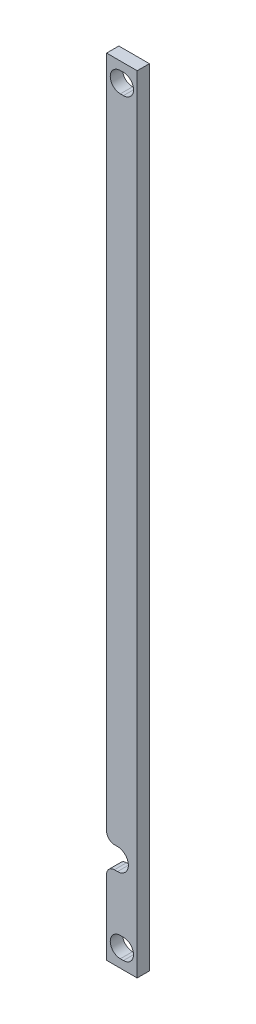
ISO-10303-21;
HEADER;
FILE_DESCRIPTION(('STEP AP214'),'2;1');
FILE_NAME('part.step','',(''),(''),'','','');
FILE_SCHEMA(('AUTOMOTIVE_DESIGN { 1 0 10303 214 1 1 1 1 }'));
ENDSEC;
DATA;
#1=APPLICATION_CONTEXT('core data for automotive mechanical design processes');
#2=APPLICATION_PROTOCOL_DEFINITION('international standard','automotive_design',2000,#1);
#3=PRODUCT_CONTEXT('',#1,'mechanical');
#4=PRODUCT('Part','Part','',(#3));
#5=PRODUCT_RELATED_PRODUCT_CATEGORY('part','',(#4));
#6=PRODUCT_DEFINITION_FORMATION('','',#4);
#7=PRODUCT_DEFINITION_CONTEXT('part definition',#1,'design');
#8=PRODUCT_DEFINITION('design','',#6,#7);
#9=PRODUCT_DEFINITION_SHAPE('','',#8);
#10=(LENGTH_UNIT() NAMED_UNIT(*) SI_UNIT(.MILLI.,.METRE.));
#11=(NAMED_UNIT(*) PLANE_ANGLE_UNIT() SI_UNIT($,.RADIAN.));
#12=(NAMED_UNIT(*) SI_UNIT($,.STERADIAN.) SOLID_ANGLE_UNIT());
#13=UNCERTAINTY_MEASURE_WITH_UNIT(LENGTH_MEASURE(1.E-05),#10,'distance_accuracy_value','');
#14=(GEOMETRIC_REPRESENTATION_CONTEXT(3) GLOBAL_UNCERTAINTY_ASSIGNED_CONTEXT((#13)) GLOBAL_UNIT_ASSIGNED_CONTEXT((#10,
#11,#12)) REPRESENTATION_CONTEXT('',''));
#15=CARTESIAN_POINT('',(0.,0.,0.));
#16=DIRECTION('',(0.,0.,1.));
#17=DIRECTION('',(1.,0.,0.));
#18=AXIS2_PLACEMENT_3D('',#15,#16,#17);
#19=CARTESIAN_POINT('',(-2.50000000000001,64.25,2.));
#20=DIRECTION('',(1.,0.,0.));
#21=DIRECTION('',(0.,1.,0.));
#22=AXIS2_PLACEMENT_3D('',#19,#20,#21);
#23=PLANE('',#22);
#24=DIRECTION('',(0.,-1.,0.));
#25=VECTOR('',#24,1.);
#26=CARTESIAN_POINT('',(-2.50000000000001,64.25,2.));
#27=LINE('',#26,#25);
#28=CARTESIAN_POINT('',(-2.49999999999999,-52.058,2.));
#29=VERTEX_POINT('',#28);
#30=CARTESIAN_POINT('',(-2.49999999999999,-64.25,2.));
#31=VERTEX_POINT('',#30);
#32=EDGE_CURVE('E300',#29,#31,#27,.T.);
#33=ORIENTED_EDGE('',*,*,#32,.F.);
#34=DIRECTION('',(0.,0.,-1.));
#35=VECTOR('',#34,1.);
#36=CARTESIAN_POINT('',(-2.49999999999999,-52.058,2.));
#37=LINE('',#36,#35);
#38=CARTESIAN_POINT('',(-2.49999999999999,-52.058,0.));
#39=VERTEX_POINT('',#38);
#40=EDGE_CURVE('E339',#29,#39,#37,.T.);
#41=ORIENTED_EDGE('',*,*,#40,.T.);
#42=DIRECTION('',(0.,-1.,0.));
#43=VECTOR('',#42,1.);
#44=CARTESIAN_POINT('',(-2.50000000000001,64.25,0.));
#45=LINE('',#44,#43);
#46=CARTESIAN_POINT('',(-2.49999999999999,-64.25,0.));
#47=VERTEX_POINT('',#46);
#48=EDGE_CURVE('E314',#39,#47,#45,.T.);
#49=ORIENTED_EDGE('',*,*,#48,.T.);
#50=DIRECTION('',(0.,0.,-1.));
#51=VECTOR('',#50,1.);
#52=CARTESIAN_POINT('',(-2.49999999999999,-64.25,2.));
#53=LINE('',#52,#51);
#54=EDGE_CURVE('E324',#31,#47,#53,.T.);
#55=ORIENTED_EDGE('',*,*,#54,.F.);
#56=EDGE_LOOP('',(#33,#41,#49,#55));
#57=FACE_BOUND('',#56,.T.);
#58=ADVANCED_FACE('F45',(#57),#23,.F.);
#59=CARTESIAN_POINT('',(0.,0.,2.));
#60=DIRECTION('',(0.,0.,1.));
#61=DIRECTION('',(1.,0.,0.));
#62=AXIS2_PLACEMENT_3D('',#59,#60,#61);
#63=PLANE('',#62);
#64=DIRECTION('',(1.,0.,0.));
#65=VECTOR('',#64,1.);
#66=CARTESIAN_POINT('',(-2.49999999999999,-50.788,2.));
#67=LINE('',#66,#65);
#68=CARTESIAN_POINT('',(-1.22999999999999,-50.788,2.));
#69=VERTEX_POINT('',#68);
#70=CARTESIAN_POINT('',(-0.722000000000006,-50.788,2.));
#71=VERTEX_POINT('',#70);
#72=EDGE_CURVE('E181',#69,#71,#67,.T.);
#73=ORIENTED_EDGE('',*,*,#72,.F.);
#74=CARTESIAN_POINT('',(-1.22999999999999,-52.058,2.));
#75=DIRECTION('',(0.,0.,1.));
#76=DIRECTION('',(1.,0.,0.));
#77=AXIS2_PLACEMENT_3D('',#74,#75,#76);
#78=CIRCLE('',#77,1.27);
#79=EDGE_CURVE('E354',#69,#29,#78,.T.);
#80=ORIENTED_EDGE('',*,*,#79,.T.);
#81=ORIENTED_EDGE('',*,*,#32,.T.);
#82=DIRECTION('',(1.,0.,0.));
#83=VECTOR('',#82,1.);
#84=CARTESIAN_POINT('',(-2.49999999999999,-64.25,2.));
#85=LINE('',#84,#83);
#86=CARTESIAN_POINT('',(2.50000000000001,-64.25,2.));
#87=VERTEX_POINT('',#86);
#88=EDGE_CURVE('E304',#31,#87,#85,.T.);
#89=ORIENTED_EDGE('',*,*,#88,.T.);
#90=DIRECTION('',(0.,1.,0.));
#91=VECTOR('',#90,1.);
#92=CARTESIAN_POINT('',(2.49999999999999,64.25,2.));
#93=LINE('',#92,#91);
#94=CARTESIAN_POINT('',(2.49999999999999,64.25,2.));
#95=VERTEX_POINT('',#94);
#96=EDGE_CURVE('E292',#87,#95,#93,.T.);
#97=ORIENTED_EDGE('',*,*,#96,.T.);
#98=DIRECTION('',(-1.,0.,0.));
#99=VECTOR('',#98,1.);
#100=CARTESIAN_POINT('',(-2.50000000000001,64.25,2.));
#101=LINE('',#100,#99);
#102=CARTESIAN_POINT('',(-2.50000000000001,64.25,2.));
#103=VERTEX_POINT('',#102);
#104=EDGE_CURVE('E296',#95,#103,#101,.T.);
#105=ORIENTED_EDGE('',*,*,#104,.T.);
#106=CARTESIAN_POINT('',(-2.49999999999999,-45.962,2.));
#107=VERTEX_POINT('',#106);
#108=EDGE_CURVE('E301',#103,#107,#27,.T.);
#109=ORIENTED_EDGE('',*,*,#108,.T.);
#110=CARTESIAN_POINT('',(-1.22999999999999,-45.962,2.));
#111=DIRECTION('',(0.,0.,1.));
#112=DIRECTION('',(1.,0.,0.));
#113=AXIS2_PLACEMENT_3D('',#110,#111,#112);
#114=CIRCLE('',#113,1.27);
#115=CARTESIAN_POINT('',(-1.23,-47.232,2.));
#116=VERTEX_POINT('',#115);
#117=EDGE_CURVE('E61',#107,#116,#114,.T.);
#118=ORIENTED_EDGE('',*,*,#117,.T.);
#119=DIRECTION('',(-1.,0.,0.));
#120=VECTOR('',#119,1.);
#121=CARTESIAN_POINT('',(-0.722000000000006,-47.232,2.));
#122=LINE('',#121,#120);
#123=CARTESIAN_POINT('',(-0.722000000000006,-47.232,2.));
#124=VERTEX_POINT('',#123);
#125=EDGE_CURVE('E173',#124,#116,#122,.T.);
#126=ORIENTED_EDGE('',*,*,#125,.F.);
#127=CARTESIAN_POINT('',(-0.722000000000006,-49.01,2.));
#128=DIRECTION('',(0.,0.,1.));
#129=DIRECTION('',(1.,0.,0.));
#130=AXIS2_PLACEMENT_3D('',#127,#128,#129);
#131=CIRCLE('',#130,1.778);
#132=EDGE_CURVE('E185',#71,#124,#131,.T.);
#133=ORIENTED_EDGE('',*,*,#132,.F.);
#134=EDGE_LOOP('',(#73,#80,#81,#89,#97,#105,#109,#118,#126,#133));
#135=FACE_BOUND('',#134,.T.);
#136=DIRECTION('',(1.,0.,0.));
#137=VECTOR('',#136,1.);
#138=CARTESIAN_POINT('',(-0.253999999999985,-62.9,2.));
#139=LINE('',#138,#137);
#140=CARTESIAN_POINT('',(-0.253999999999985,-62.9,2.));
#141=VERTEX_POINT('',#140);
#142=CARTESIAN_POINT('',(0.254000000000016,-62.9,2.));
#143=VERTEX_POINT('',#142);
#144=EDGE_CURVE('E252',#141,#143,#139,.T.);
#145=ORIENTED_EDGE('',*,*,#144,.F.);
#146=CARTESIAN_POINT('',(-0.253999999999984,-61.25,2.));
#147=DIRECTION('',(0.,0.,1.));
#148=DIRECTION('',(1.,0.,0.));
#149=AXIS2_PLACEMENT_3D('',#146,#147,#148);
#150=CIRCLE('',#149,1.65);
#151=CARTESIAN_POINT('',(-0.253999999999985,-59.6,2.));
#152=VERTEX_POINT('',#151);
#153=EDGE_CURVE('E249',#152,#141,#150,.T.);
#154=ORIENTED_EDGE('',*,*,#153,.F.);
#155=DIRECTION('',(-1.,0.,0.));
#156=VECTOR('',#155,1.);
#157=CARTESIAN_POINT('',(-0.253999999999985,-59.6,2.));
#158=LINE('',#157,#156);
#159=CARTESIAN_POINT('',(0.254000000000015,-59.6,2.));
#160=VERTEX_POINT('',#159);
#161=EDGE_CURVE('E260',#160,#152,#158,.T.);
#162=ORIENTED_EDGE('',*,*,#161,.F.);
#163=CARTESIAN_POINT('',(0.254000000000015,-61.25,2.));
#164=DIRECTION('',(0.,0.,1.));
#165=DIRECTION('',(1.,0.,0.));
#166=AXIS2_PLACEMENT_3D('',#163,#164,#165);
#167=CIRCLE('',#166,1.65);
#168=EDGE_CURVE('E256',#143,#160,#167,.T.);
#169=ORIENTED_EDGE('',*,*,#168,.F.);
#170=EDGE_LOOP('',(#145,#154,#162,#169));
#171=FACE_BOUND('',#170,.T.);
#172=DIRECTION('',(1.,0.,0.));
#173=VECTOR('',#172,1.);
#174=CARTESIAN_POINT('',(-0.253999999999999,59.6,2.));
#175=LINE('',#174,#173);
#176=CARTESIAN_POINT('',(-0.253999999999999,59.6,2.));
#177=VERTEX_POINT('',#176);
#178=CARTESIAN_POINT('',(0.254,59.6,2.));
#179=VERTEX_POINT('',#178);
#180=EDGE_CURVE('E209',#177,#179,#175,.T.);
#181=ORIENTED_EDGE('',*,*,#180,.F.);
#182=CARTESIAN_POINT('',(-0.254,61.25,2.));
#183=DIRECTION('',(0.,0.,1.));
#184=DIRECTION('',(1.,0.,0.));
#185=AXIS2_PLACEMENT_3D('',#182,#183,#184);
#186=CIRCLE('',#185,1.65);
#187=CARTESIAN_POINT('',(-0.254,62.9,2.));
#188=VERTEX_POINT('',#187);
#189=EDGE_CURVE('E206',#188,#177,#186,.T.);
#190=ORIENTED_EDGE('',*,*,#189,.F.);
#191=DIRECTION('',(-1.,0.,0.));
#192=VECTOR('',#191,1.);
#193=CARTESIAN_POINT('',(-0.254,62.9,2.));
#194=LINE('',#193,#192);
#195=CARTESIAN_POINT('',(0.254,62.9,2.));
#196=VERTEX_POINT('',#195);
#197=EDGE_CURVE('E217',#196,#188,#194,.T.);
#198=ORIENTED_EDGE('',*,*,#197,.F.);
#199=CARTESIAN_POINT('',(0.254,61.25,2.));
#200=DIRECTION('',(0.,0.,1.));
#201=DIRECTION('',(1.,0.,0.));
#202=AXIS2_PLACEMENT_3D('',#199,#200,#201);
#203=CIRCLE('',#202,1.65);
#204=EDGE_CURVE('E213',#179,#196,#203,.T.);
#205=ORIENTED_EDGE('',*,*,#204,.F.);
#206=EDGE_LOOP('',(#181,#190,#198,#205));
#207=FACE_BOUND('',#206,.T.);
#208=ADVANCED_FACE('F191',(#135,#171,#207),#63,.T.);
#209=CARTESIAN_POINT('',(0.,0.,0.));
#210=DIRECTION('',(0.,0.,1.));
#211=DIRECTION('',(1.,0.,0.));
#212=AXIS2_PLACEMENT_3D('',#209,#210,#211);
#213=PLANE('',#212);
#214=CARTESIAN_POINT('',(-0.253999999999984,-61.25,0.));
#215=DIRECTION('',(0.,0.,1.));
#216=DIRECTION('',(1.,0.,0.));
#217=AXIS2_PLACEMENT_3D('',#214,#215,#216);
#218=CIRCLE('',#217,1.65);
#219=CARTESIAN_POINT('',(-0.253999999999985,-59.6,0.));
#220=VERTEX_POINT('',#219);
#221=CARTESIAN_POINT('',(-0.253999999999985,-62.9,0.));
#222=VERTEX_POINT('',#221);
#223=EDGE_CURVE('E248',#220,#222,#218,.T.);
#224=ORIENTED_EDGE('',*,*,#223,.T.);
#225=DIRECTION('',(1.,0.,0.));
#226=VECTOR('',#225,1.);
#227=CARTESIAN_POINT('',(-0.253999999999985,-62.9,0.));
#228=LINE('',#227,#226);
#229=CARTESIAN_POINT('',(0.254000000000016,-62.9,0.));
#230=VERTEX_POINT('',#229);
#231=EDGE_CURVE('E267',#222,#230,#228,.T.);
#232=ORIENTED_EDGE('',*,*,#231,.T.);
#233=CARTESIAN_POINT('',(0.254000000000015,-61.25,0.));
#234=DIRECTION('',(0.,0.,1.));
#235=DIRECTION('',(1.,0.,0.));
#236=AXIS2_PLACEMENT_3D('',#233,#234,#235);
#237=CIRCLE('',#236,1.65);
#238=CARTESIAN_POINT('',(0.254000000000015,-59.6,0.));
#239=VERTEX_POINT('',#238);
#240=EDGE_CURVE('E271',#230,#239,#237,.T.);
#241=ORIENTED_EDGE('',*,*,#240,.T.);
#242=DIRECTION('',(-1.,0.,0.));
#243=VECTOR('',#242,1.);
#244=CARTESIAN_POINT('',(-0.253999999999985,-59.6,0.));
#245=LINE('',#244,#243);
#246=EDGE_CURVE('E253',#239,#220,#245,.T.);
#247=ORIENTED_EDGE('',*,*,#246,.T.);
#248=EDGE_LOOP('',(#224,#232,#241,#247));
#249=FACE_BOUND('',#248,.T.);
#250=ORIENTED_EDGE('',*,*,#48,.F.);
#251=CARTESIAN_POINT('',(-1.22999999999999,-52.058,0.));
#252=DIRECTION('',(0.,0.,1.));
#253=DIRECTION('',(1.,0.,0.));
#254=AXIS2_PLACEMENT_3D('',#251,#252,#253);
#255=CIRCLE('',#254,1.27);
#256=CARTESIAN_POINT('',(-1.22999999999999,-50.788,0.));
#257=VERTEX_POINT('',#256);
#258=EDGE_CURVE('E346',#39,#257,#255,.F.);
#259=ORIENTED_EDGE('',*,*,#258,.T.);
#260=DIRECTION('',(1.,0.,0.));
#261=VECTOR('',#260,1.);
#262=CARTESIAN_POINT('',(-1.98207279860317E-13,-50.788,0.));
#263=LINE('',#262,#261);
#264=CARTESIAN_POINT('',(-0.722000000000006,-50.788,0.));
#265=VERTEX_POINT('',#264);
#266=EDGE_CURVE('E202',#257,#265,#263,.T.);
#267=ORIENTED_EDGE('',*,*,#266,.T.);
#268=CARTESIAN_POINT('',(-0.722000000000006,-49.01,0.));
#269=DIRECTION('',(0.,0.,1.));
#270=DIRECTION('',(1.,0.,0.));
#271=AXIS2_PLACEMENT_3D('',#268,#269,#270);
#272=CIRCLE('',#271,1.778);
#273=CARTESIAN_POINT('',(-0.722000000000006,-47.232,0.));
#274=VERTEX_POINT('',#273);
#275=EDGE_CURVE('E336',#265,#274,#272,.T.);
#276=ORIENTED_EDGE('',*,*,#275,.T.);
#277=DIRECTION('',(-1.,0.,0.));
#278=VECTOR('',#277,1.);
#279=CARTESIAN_POINT('',(-1.84329492052502E-13,-47.232,0.));
#280=LINE('',#279,#278);
#281=CARTESIAN_POINT('',(-1.23,-47.232,0.));
#282=VERTEX_POINT('',#281);
#283=EDGE_CURVE('E175',#274,#282,#280,.T.);
#284=ORIENTED_EDGE('',*,*,#283,.T.);
#285=CARTESIAN_POINT('',(-1.22999999999999,-45.962,0.));
#286=DIRECTION('',(0.,0.,1.));
#287=DIRECTION('',(1.,0.,0.));
#288=AXIS2_PLACEMENT_3D('',#285,#286,#287);
#289=CIRCLE('',#288,1.27);
#290=CARTESIAN_POINT('',(-2.49999999999999,-45.962,0.));
#291=VERTEX_POINT('',#290);
#292=EDGE_CURVE('E343',#282,#291,#289,.F.);
#293=ORIENTED_EDGE('',*,*,#292,.T.);
#294=CARTESIAN_POINT('',(-2.50000000000001,64.25,0.));
#295=VERTEX_POINT('',#294);
#296=EDGE_CURVE('E315',#295,#291,#45,.T.);
#297=ORIENTED_EDGE('',*,*,#296,.F.);
#298=DIRECTION('',(-1.,0.,0.));
#299=VECTOR('',#298,1.);
#300=CARTESIAN_POINT('',(-2.50000000000001,64.25,0.));
#301=LINE('',#300,#299);
#302=CARTESIAN_POINT('',(2.49999999999999,64.25,0.));
#303=VERTEX_POINT('',#302);
#304=EDGE_CURVE('E311',#303,#295,#301,.T.);
#305=ORIENTED_EDGE('',*,*,#304,.F.);
#306=DIRECTION('',(0.,1.,0.));
#307=VECTOR('',#306,1.);
#308=CARTESIAN_POINT('',(2.49999999999999,64.25,0.));
#309=LINE('',#308,#307);
#310=CARTESIAN_POINT('',(2.50000000000001,-64.25,0.));
#311=VERTEX_POINT('',#310);
#312=EDGE_CURVE('E291',#311,#303,#309,.T.);
#313=ORIENTED_EDGE('',*,*,#312,.F.);
#314=DIRECTION('',(1.,0.,0.));
#315=VECTOR('',#314,1.);
#316=CARTESIAN_POINT('',(-2.49999999999999,-64.25,0.));
#317=LINE('',#316,#315);
#318=EDGE_CURVE('E297',#47,#311,#317,.T.);
#319=ORIENTED_EDGE('',*,*,#318,.F.);
#320=EDGE_LOOP('',(#250,#259,#267,#276,#284,#293,#297,#305,#313,#319));
#321=FACE_BOUND('',#320,.T.);
#322=CARTESIAN_POINT('',(-0.254,61.25,0.));
#323=DIRECTION('',(0.,0.,1.));
#324=DIRECTION('',(1.,0.,0.));
#325=AXIS2_PLACEMENT_3D('',#322,#323,#324);
#326=CIRCLE('',#325,1.65);
#327=CARTESIAN_POINT('',(-0.254,62.9,0.));
#328=VERTEX_POINT('',#327);
#329=CARTESIAN_POINT('',(-0.253999999999999,59.6,0.));
#330=VERTEX_POINT('',#329);
#331=EDGE_CURVE('E205',#328,#330,#326,.T.);
#332=ORIENTED_EDGE('',*,*,#331,.T.);
#333=DIRECTION('',(1.,0.,0.));
#334=VECTOR('',#333,1.);
#335=CARTESIAN_POINT('',(-0.253999999999999,59.6,0.));
#336=LINE('',#335,#334);
#337=CARTESIAN_POINT('',(0.254,59.6,0.));
#338=VERTEX_POINT('',#337);
#339=EDGE_CURVE('E224',#330,#338,#336,.T.);
#340=ORIENTED_EDGE('',*,*,#339,.T.);
#341=CARTESIAN_POINT('',(0.254,61.25,0.));
#342=DIRECTION('',(0.,0.,1.));
#343=DIRECTION('',(1.,0.,0.));
#344=AXIS2_PLACEMENT_3D('',#341,#342,#343);
#345=CIRCLE('',#344,1.65);
#346=CARTESIAN_POINT('',(0.254,62.9,0.));
#347=VERTEX_POINT('',#346);
#348=EDGE_CURVE('E228',#338,#347,#345,.T.);
#349=ORIENTED_EDGE('',*,*,#348,.T.);
#350=DIRECTION('',(-1.,0.,0.));
#351=VECTOR('',#350,1.);
#352=CARTESIAN_POINT('',(-0.254,62.9,0.));
#353=LINE('',#352,#351);
#354=EDGE_CURVE('E210',#347,#328,#353,.T.);
#355=ORIENTED_EDGE('',*,*,#354,.T.);
#356=EDGE_LOOP('',(#332,#340,#349,#355));
#357=FACE_BOUND('',#356,.T.);
#358=ADVANCED_FACE('F369',(#249,#321,#357),#213,.F.);
#359=CARTESIAN_POINT('',(2.49999999999999,64.25,2.));
#360=DIRECTION('',(-1.,0.,0.));
#361=DIRECTION('',(0.,-1.,0.));
#362=AXIS2_PLACEMENT_3D('',#359,#360,#361);
#363=PLANE('',#362);
#364=ORIENTED_EDGE('',*,*,#312,.T.);
#365=DIRECTION('',(0.,0.,-1.));
#366=VECTOR('',#365,1.);
#367=CARTESIAN_POINT('',(2.49999999999999,64.25,2.));
#368=LINE('',#367,#366);
#369=EDGE_CURVE('E332',#95,#303,#368,.T.);
#370=ORIENTED_EDGE('',*,*,#369,.F.);
#371=ORIENTED_EDGE('',*,*,#96,.F.);
#372=DIRECTION('',(0.,0.,-1.));
#373=VECTOR('',#372,1.);
#374=CARTESIAN_POINT('',(2.50000000000001,-64.25,2.));
#375=LINE('',#374,#373);
#376=EDGE_CURVE('E307',#87,#311,#375,.T.);
#377=ORIENTED_EDGE('',*,*,#376,.T.);
#378=EDGE_LOOP('',(#364,#370,#371,#377));
#379=FACE_BOUND('',#378,.T.);
#380=ADVANCED_FACE('F399',(#379),#363,.F.);
#381=CARTESIAN_POINT('',(-2.50000000000001,64.25,2.));
#382=DIRECTION('',(0.,-1.,0.));
#383=DIRECTION('',(0.,0.,-1.));
#384=AXIS2_PLACEMENT_3D('',#381,#382,#383);
#385=PLANE('',#384);
#386=ORIENTED_EDGE('',*,*,#304,.T.);
#387=DIRECTION('',(0.,0.,-1.));
#388=VECTOR('',#387,1.);
#389=CARTESIAN_POINT('',(-2.50000000000001,64.25,2.));
#390=LINE('',#389,#388);
#391=EDGE_CURVE('E328',#103,#295,#390,.T.);
#392=ORIENTED_EDGE('',*,*,#391,.F.);
#393=ORIENTED_EDGE('',*,*,#104,.F.);
#394=ORIENTED_EDGE('',*,*,#369,.T.);
#395=EDGE_LOOP('',(#386,#392,#393,#394));
#396=FACE_BOUND('',#395,.T.);
#397=ADVANCED_FACE('F366',(#396),#385,.F.);
#398=ORIENTED_EDGE('',*,*,#296,.T.);
#399=DIRECTION('',(0.,0.,1.));
#400=VECTOR('',#399,1.);
#401=CARTESIAN_POINT('',(-2.49999999999999,-45.962,2.));
#402=LINE('',#401,#400);
#403=EDGE_CURVE('E54',#291,#107,#402,.T.);
#404=ORIENTED_EDGE('',*,*,#403,.T.);
#405=ORIENTED_EDGE('',*,*,#108,.F.);
#406=ORIENTED_EDGE('',*,*,#391,.T.);
#407=EDGE_LOOP('',(#398,#404,#405,#406));
#408=FACE_BOUND('',#407,.T.);
#409=ADVANCED_FACE('F359',(#408),#23,.F.);
#410=CARTESIAN_POINT('',(-2.49999999999999,-64.25,2.));
#411=DIRECTION('',(0.,1.,0.));
#412=DIRECTION('',(0.,0.,1.));
#413=AXIS2_PLACEMENT_3D('',#410,#411,#412);
#414=PLANE('',#413);
#415=ORIENTED_EDGE('',*,*,#318,.T.);
#416=ORIENTED_EDGE('',*,*,#376,.F.);
#417=ORIENTED_EDGE('',*,*,#88,.F.);
#418=ORIENTED_EDGE('',*,*,#54,.T.);
#419=EDGE_LOOP('',(#415,#416,#417,#418));
#420=FACE_BOUND('',#419,.T.);
#421=ADVANCED_FACE('F390',(#420),#414,.F.);
#422=CARTESIAN_POINT('',(-0.253999999999984,-61.25,2.));
#423=DIRECTION('',(0.,0.,-1.));
#424=DIRECTION('',(-1.,0.,0.));
#425=AXIS2_PLACEMENT_3D('',#422,#423,#424);
#426=CYLINDRICAL_SURFACE('',#425,1.65);
#427=ORIENTED_EDGE('',*,*,#223,.F.);
#428=DIRECTION('',(0.,0.,-1.));
#429=VECTOR('',#428,1.);
#430=CARTESIAN_POINT('',(-0.253999999999985,-59.6,2.));
#431=LINE('',#430,#429);
#432=EDGE_CURVE('E263',#152,#220,#431,.T.);
#433=ORIENTED_EDGE('',*,*,#432,.F.);
#434=ORIENTED_EDGE('',*,*,#153,.T.);
#435=DIRECTION('',(0.,0.,-1.));
#436=VECTOR('',#435,1.);
#437=CARTESIAN_POINT('',(-0.253999999999985,-62.9,2.));
#438=LINE('',#437,#436);
#439=EDGE_CURVE('E287',#141,#222,#438,.T.);
#440=ORIENTED_EDGE('',*,*,#439,.T.);
#441=EDGE_LOOP('',(#427,#433,#434,#440));
#442=FACE_BOUND('',#441,.T.);
#443=ADVANCED_FACE('F396',(#442),#426,.F.);
#444=CARTESIAN_POINT('',(-0.253999999999985,-62.9,2.));
#445=DIRECTION('',(0.,1.,0.));
#446=DIRECTION('',(0.,0.,1.));
#447=AXIS2_PLACEMENT_3D('',#444,#445,#446);
#448=PLANE('',#447);
#449=ORIENTED_EDGE('',*,*,#231,.F.);
#450=ORIENTED_EDGE('',*,*,#439,.F.);
#451=ORIENTED_EDGE('',*,*,#144,.T.);
#452=DIRECTION('',(0.,0.,-1.));
#453=VECTOR('',#452,1.);
#454=CARTESIAN_POINT('',(0.254000000000016,-62.9,2.));
#455=LINE('',#454,#453);
#456=EDGE_CURVE('E284',#143,#230,#455,.T.);
#457=ORIENTED_EDGE('',*,*,#456,.T.);
#458=EDGE_LOOP('',(#449,#450,#451,#457));
#459=FACE_BOUND('',#458,.T.);
#460=ADVANCED_FACE('F451',(#459),#448,.T.);
#461=CARTESIAN_POINT('',(0.254000000000015,-61.25,2.));
#462=DIRECTION('',(0.,0.,-1.));
#463=DIRECTION('',(-1.,0.,0.));
#464=AXIS2_PLACEMENT_3D('',#461,#462,#463);
#465=CYLINDRICAL_SURFACE('',#464,1.65);
#466=ORIENTED_EDGE('',*,*,#240,.F.);
#467=ORIENTED_EDGE('',*,*,#456,.F.);
#468=ORIENTED_EDGE('',*,*,#168,.T.);
#469=DIRECTION('',(0.,0.,-1.));
#470=VECTOR('',#469,1.);
#471=CARTESIAN_POINT('',(0.254000000000015,-59.6,2.));
#472=LINE('',#471,#470);
#473=EDGE_CURVE('E281',#160,#239,#472,.T.);
#474=ORIENTED_EDGE('',*,*,#473,.T.);
#475=EDGE_LOOP('',(#466,#467,#468,#474));
#476=FACE_BOUND('',#475,.T.);
#477=ADVANCED_FACE('F447',(#476),#465,.F.);
#478=CARTESIAN_POINT('',(-0.253999999999985,-59.6,2.));
#479=DIRECTION('',(0.,-1.,0.));
#480=DIRECTION('',(0.,0.,-1.));
#481=AXIS2_PLACEMENT_3D('',#478,#479,#480);
#482=PLANE('',#481);
#483=ORIENTED_EDGE('',*,*,#246,.F.);
#484=ORIENTED_EDGE('',*,*,#473,.F.);
#485=ORIENTED_EDGE('',*,*,#161,.T.);
#486=ORIENTED_EDGE('',*,*,#432,.T.);
#487=EDGE_LOOP('',(#483,#484,#485,#486));
#488=FACE_BOUND('',#487,.T.);
#489=ADVANCED_FACE('F443',(#488),#482,.T.);
#490=CARTESIAN_POINT('',(-0.254,61.25,2.));
#491=DIRECTION('',(0.,0.,-1.));
#492=DIRECTION('',(-1.,0.,0.));
#493=AXIS2_PLACEMENT_3D('',#490,#491,#492);
#494=CYLINDRICAL_SURFACE('',#493,1.65);
#495=ORIENTED_EDGE('',*,*,#331,.F.);
#496=DIRECTION('',(0.,0.,-1.));
#497=VECTOR('',#496,1.);
#498=CARTESIAN_POINT('',(-0.254,62.9,2.));
#499=LINE('',#498,#497);
#500=EDGE_CURVE('E220',#188,#328,#499,.T.);
#501=ORIENTED_EDGE('',*,*,#500,.F.);
#502=ORIENTED_EDGE('',*,*,#189,.T.);
#503=DIRECTION('',(0.,0.,-1.));
#504=VECTOR('',#503,1.);
#505=CARTESIAN_POINT('',(-0.253999999999999,59.6,2.));
#506=LINE('',#505,#504);
#507=EDGE_CURVE('E244',#177,#330,#506,.T.);
#508=ORIENTED_EDGE('',*,*,#507,.T.);
#509=EDGE_LOOP('',(#495,#501,#502,#508));
#510=FACE_BOUND('',#509,.T.);
#511=ADVANCED_FACE('F439',(#510),#494,.F.);
#512=CARTESIAN_POINT('',(-0.253999999999999,59.6,2.));
#513=DIRECTION('',(0.,1.,0.));
#514=DIRECTION('',(0.,0.,1.));
#515=AXIS2_PLACEMENT_3D('',#512,#513,#514);
#516=PLANE('',#515);
#517=ORIENTED_EDGE('',*,*,#339,.F.);
#518=ORIENTED_EDGE('',*,*,#507,.F.);
#519=ORIENTED_EDGE('',*,*,#180,.T.);
#520=DIRECTION('',(0.,0.,-1.));
#521=VECTOR('',#520,1.);
#522=CARTESIAN_POINT('',(0.254,59.6,2.));
#523=LINE('',#522,#521);
#524=EDGE_CURVE('E241',#179,#338,#523,.T.);
#525=ORIENTED_EDGE('',*,*,#524,.T.);
#526=EDGE_LOOP('',(#517,#518,#519,#525));
#527=FACE_BOUND('',#526,.T.);
#528=ADVANCED_FACE('F435',(#527),#516,.T.);
#529=CARTESIAN_POINT('',(0.254,61.25,2.));
#530=DIRECTION('',(0.,0.,-1.));
#531=DIRECTION('',(-1.,0.,0.));
#532=AXIS2_PLACEMENT_3D('',#529,#530,#531);
#533=CYLINDRICAL_SURFACE('',#532,1.65);
#534=ORIENTED_EDGE('',*,*,#348,.F.);
#535=ORIENTED_EDGE('',*,*,#524,.F.);
#536=ORIENTED_EDGE('',*,*,#204,.T.);
#537=DIRECTION('',(0.,0.,-1.));
#538=VECTOR('',#537,1.);
#539=CARTESIAN_POINT('',(0.254,62.9,2.));
#540=LINE('',#539,#538);
#541=EDGE_CURVE('E238',#196,#347,#540,.T.);
#542=ORIENTED_EDGE('',*,*,#541,.T.);
#543=EDGE_LOOP('',(#534,#535,#536,#542));
#544=FACE_BOUND('',#543,.T.);
#545=ADVANCED_FACE('F431',(#544),#533,.F.);
#546=CARTESIAN_POINT('',(-0.254,62.9,2.));
#547=DIRECTION('',(0.,-1.,0.));
#548=DIRECTION('',(0.,0.,-1.));
#549=AXIS2_PLACEMENT_3D('',#546,#547,#548);
#550=PLANE('',#549);
#551=ORIENTED_EDGE('',*,*,#354,.F.);
#552=ORIENTED_EDGE('',*,*,#541,.F.);
#553=ORIENTED_EDGE('',*,*,#197,.T.);
#554=ORIENTED_EDGE('',*,*,#500,.T.);
#555=EDGE_LOOP('',(#551,#552,#553,#554));
#556=FACE_BOUND('',#555,.T.);
#557=ADVANCED_FACE('F426',(#556),#550,.T.);
#558=CARTESIAN_POINT('',(-0.722000000000006,-49.01,-0.54));
#559=DIRECTION('',(0.,0.,1.));
#560=DIRECTION('',(1.,0.,0.));
#561=AXIS2_PLACEMENT_3D('',#558,#559,#560);
#562=CYLINDRICAL_SURFACE('',#561,1.778);
#563=DIRECTION('',(0.,0.,1.));
#564=VECTOR('',#563,1.);
#565=CARTESIAN_POINT('',(-0.722000000000006,-50.788,-0.54));
#566=LINE('',#565,#564);
#567=EDGE_CURVE('E180',#265,#71,#566,.T.);
#568=ORIENTED_EDGE('',*,*,#567,.T.);
#569=ORIENTED_EDGE('',*,*,#132,.T.);
#570=DIRECTION('',(0.,0.,1.));
#571=VECTOR('',#570,1.);
#572=CARTESIAN_POINT('',(-0.722000000000006,-47.232,-0.54));
#573=LINE('',#572,#571);
#574=EDGE_CURVE('E170',#274,#124,#573,.T.);
#575=ORIENTED_EDGE('',*,*,#574,.F.);
#576=ORIENTED_EDGE('',*,*,#275,.F.);
#577=EDGE_LOOP('',(#568,#569,#575,#576));
#578=FACE_BOUND('',#577,.T.);
#579=ADVANCED_FACE('F186',(#578),#562,.F.);
#580=CARTESIAN_POINT('',(-2.49999999999999,-50.788,-0.54));
#581=DIRECTION('',(0.,-1.,0.));
#582=DIRECTION('',(1.,0.,0.));
#583=AXIS2_PLACEMENT_3D('',#580,#581,#582);
#584=PLANE('',#583);
#585=ORIENTED_EDGE('',*,*,#266,.F.);
#586=DIRECTION('',(0.,0.,-1.));
#587=VECTOR('',#586,1.);
#588=CARTESIAN_POINT('',(-1.22999999999999,-50.788,-0.54));
#589=LINE('',#588,#587);
#590=EDGE_CURVE('E349',#257,#69,#589,.F.);
#591=ORIENTED_EDGE('',*,*,#590,.T.);
#592=ORIENTED_EDGE('',*,*,#72,.T.);
#593=ORIENTED_EDGE('',*,*,#567,.F.);
#594=EDGE_LOOP('',(#585,#591,#592,#593));
#595=FACE_BOUND('',#594,.T.);
#596=ADVANCED_FACE('F420',(#595),#584,.F.);
#597=CARTESIAN_POINT('',(-0.722000000000006,-47.232,-0.54));
#598=DIRECTION('',(0.,1.,0.));
#599=DIRECTION('',(-1.,0.,0.));
#600=AXIS2_PLACEMENT_3D('',#597,#598,#599);
#601=PLANE('',#600);
#602=ORIENTED_EDGE('',*,*,#125,.T.);
#603=DIRECTION('',(0.,0.,1.));
#604=VECTOR('',#603,1.);
#605=CARTESIAN_POINT('',(-1.23,-47.232,-0.54));
#606=LINE('',#605,#604);
#607=EDGE_CURVE('E11',#116,#282,#606,.F.);
#608=ORIENTED_EDGE('',*,*,#607,.T.);
#609=ORIENTED_EDGE('',*,*,#283,.F.);
#610=ORIENTED_EDGE('',*,*,#574,.T.);
#611=EDGE_LOOP('',(#602,#608,#609,#610));
#612=FACE_BOUND('',#611,.T.);
#613=ADVANCED_FACE('F172',(#612),#601,.F.);
#614=CARTESIAN_POINT('',(-1.22999999999999,-52.058,2.));
#615=DIRECTION('',(0.,0.,-1.));
#616=DIRECTION('',(-1.,0.,0.));
#617=AXIS2_PLACEMENT_3D('',#614,#615,#616);
#618=CYLINDRICAL_SURFACE('',#617,1.27);
#619=ORIENTED_EDGE('',*,*,#79,.F.);
#620=ORIENTED_EDGE('',*,*,#590,.F.);
#621=ORIENTED_EDGE('',*,*,#258,.F.);
#622=ORIENTED_EDGE('',*,*,#40,.F.);
#623=EDGE_LOOP('',(#619,#620,#621,#622));
#624=FACE_BOUND('',#623,.T.);
#625=ADVANCED_FACE('F373',(#624),#618,.T.);
#626=CARTESIAN_POINT('',(-1.22999999999999,-45.962,2.));
#627=DIRECTION('',(0.,0.,1.));
#628=DIRECTION('',(1.,0.,0.));
#629=AXIS2_PLACEMENT_3D('',#626,#627,#628);
#630=CYLINDRICAL_SURFACE('',#629,1.27);
#631=ORIENTED_EDGE('',*,*,#292,.F.);
#632=ORIENTED_EDGE('',*,*,#607,.F.);
#633=ORIENTED_EDGE('',*,*,#117,.F.);
#634=ORIENTED_EDGE('',*,*,#403,.F.);
#635=EDGE_LOOP('',(#631,#632,#633,#634));
#636=FACE_BOUND('',#635,.T.);
#637=ADVANCED_FACE('F47',(#636),#630,.T.);
#638=CLOSED_SHELL('',(#58,#208,#358,#380,#397,#409,#421,#443,#460,#477,#489,#511,#528,#545,#557,
#579,#596,#613,#625,#637));
#639=MANIFOLD_SOLID_BREP('B2',#638);
#640=ADVANCED_BREP_SHAPE_REPRESENTATION('',(#18,#639),#14);
#641=SHAPE_DEFINITION_REPRESENTATION(#9,#640);
ENDSEC;
END-ISO-10303-21;
